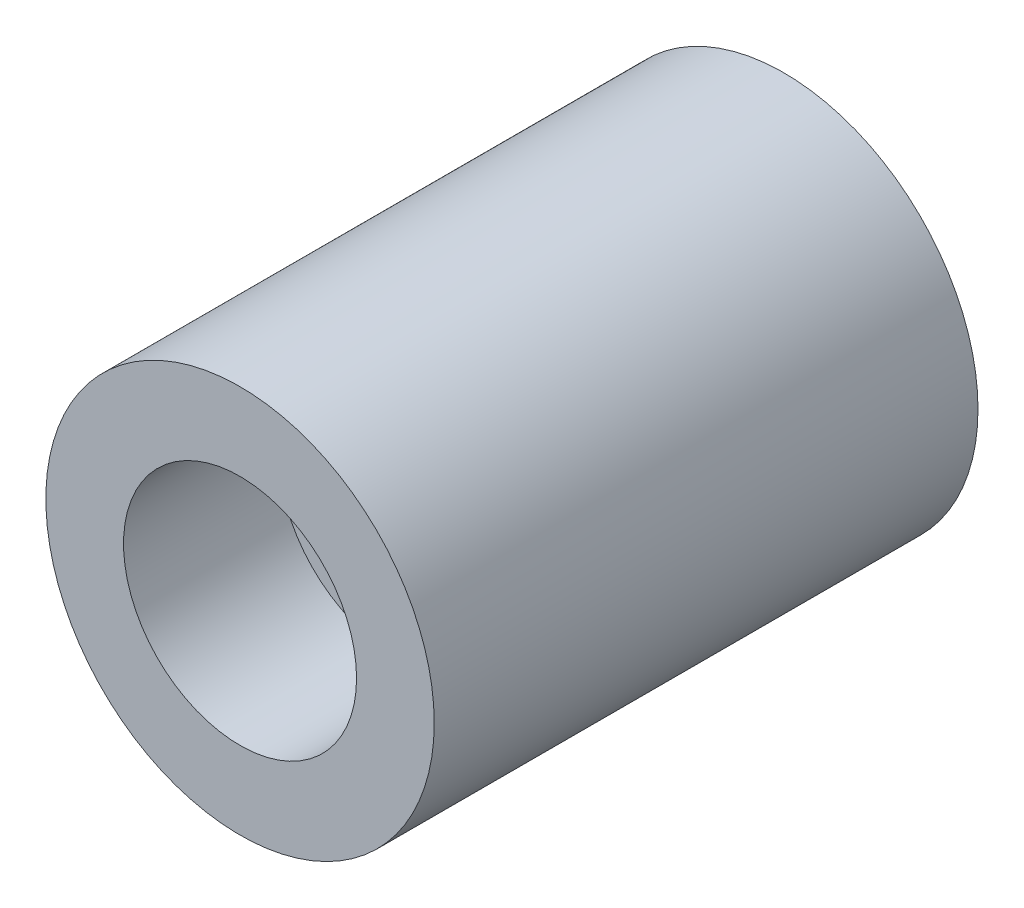
ISO-10303-21;
HEADER;
FILE_DESCRIPTION(('STEP AP214'),'2;1');
FILE_NAME('part.step','',(''),(''),'','','');
FILE_SCHEMA(('AUTOMOTIVE_DESIGN { 1 0 10303 214 1 1 1 1 }'));
ENDSEC;
DATA;
#1=APPLICATION_CONTEXT('core data for automotive mechanical design processes');
#2=APPLICATION_PROTOCOL_DEFINITION('international standard','automotive_design',2000,#1);
#3=PRODUCT_CONTEXT('',#1,'mechanical');
#4=PRODUCT('Part','Part','',(#3));
#5=PRODUCT_RELATED_PRODUCT_CATEGORY('part','',(#4));
#6=PRODUCT_DEFINITION_FORMATION('','',#4);
#7=PRODUCT_DEFINITION_CONTEXT('part definition',#1,'design');
#8=PRODUCT_DEFINITION('design','',#6,#7);
#9=PRODUCT_DEFINITION_SHAPE('','',#8);
#10=(LENGTH_UNIT() NAMED_UNIT(*) SI_UNIT(.MILLI.,.METRE.));
#11=(NAMED_UNIT(*) PLANE_ANGLE_UNIT() SI_UNIT($,.RADIAN.));
#12=(NAMED_UNIT(*) SI_UNIT($,.STERADIAN.) SOLID_ANGLE_UNIT());
#13=UNCERTAINTY_MEASURE_WITH_UNIT(LENGTH_MEASURE(1.E-05),#10,'distance_accuracy_value','');
#14=(GEOMETRIC_REPRESENTATION_CONTEXT(3) GLOBAL_UNCERTAINTY_ASSIGNED_CONTEXT((#13)) GLOBAL_UNIT_ASSIGNED_CONTEXT((#10,
#11,#12)) REPRESENTATION_CONTEXT('',''));
#15=CARTESIAN_POINT('',(0.,0.,0.));
#16=DIRECTION('',(0.,0.,1.));
#17=DIRECTION('',(1.,0.,0.));
#18=AXIS2_PLACEMENT_3D('',#15,#16,#17);
#19=CARTESIAN_POINT('',(0.,0.,140.));
#20=DIRECTION('',(0.,0.,-1.));
#21=DIRECTION('',(-1.,0.,0.));
#22=AXIS2_PLACEMENT_3D('',#19,#20,#21);
#23=CYLINDRICAL_SURFACE('',#22,50.);
#24=CARTESIAN_POINT('',(0.,0.,140.));
#25=DIRECTION('',(0.,0.,1.));
#26=DIRECTION('',(1.,0.,0.));
#27=AXIS2_PLACEMENT_3D('',#24,#25,#26);
#28=CIRCLE('',#27,50.);
#29=CARTESIAN_POINT('',(50.,0.,140.));
#30=VERTEX_POINT('',#29);
#31=EDGE_CURVE('E10',#30,#30,#28,.T.);
#32=ORIENTED_EDGE('',*,*,#31,.F.);
#33=EDGE_LOOP('',(#32));
#34=FACE_BOUND('',#33,.T.);
#35=CARTESIAN_POINT('',(0.,0.,0.));
#36=DIRECTION('',(0.,0.,1.));
#37=DIRECTION('',(1.,0.,0.));
#38=AXIS2_PLACEMENT_3D('',#35,#36,#37);
#39=CIRCLE('',#38,50.);
#40=CARTESIAN_POINT('',(50.,0.,0.));
#41=VERTEX_POINT('',#40);
#42=EDGE_CURVE('E38',#41,#41,#39,.T.);
#43=ORIENTED_EDGE('',*,*,#42,.T.);
#44=EDGE_LOOP('',(#43));
#45=FACE_BOUND('',#44,.T.);
#46=ADVANCED_FACE('F31',(#34,#45),#23,.T.);
#47=CARTESIAN_POINT('',(0.,0.,140.));
#48=DIRECTION('',(0.,0.,1.));
#49=DIRECTION('',(1.,0.,0.));
#50=AXIS2_PLACEMENT_3D('',#47,#48,#49);
#51=PLANE('',#50);
#52=CARTESIAN_POINT('',(0.,0.,140.));
#53=DIRECTION('',(0.,0.,1.));
#54=DIRECTION('',(1.,0.,0.));
#55=AXIS2_PLACEMENT_3D('',#52,#53,#54);
#56=CIRCLE('',#55,30.);
#57=CARTESIAN_POINT('',(30.,0.,140.));
#58=VERTEX_POINT('',#57);
#59=EDGE_CURVE('E45',#58,#58,#56,.T.);
#60=ORIENTED_EDGE('',*,*,#59,.F.);
#61=EDGE_LOOP('',(#60));
#62=FACE_BOUND('',#61,.T.);
#63=ORIENTED_EDGE('',*,*,#31,.T.);
#64=EDGE_LOOP('',(#63));
#65=FACE_BOUND('',#64,.T.);
#66=ADVANCED_FACE('F73',(#62,#65),#51,.T.);
#67=CARTESIAN_POINT('',(0.,0.,0.));
#68=DIRECTION('',(0.,0.,1.));
#69=DIRECTION('',(1.,0.,0.));
#70=AXIS2_PLACEMENT_3D('',#67,#68,#69);
#71=PLANE('',#70);
#72=ORIENTED_EDGE('',*,*,#42,.F.);
#73=EDGE_LOOP('',(#72));
#74=FACE_BOUND('',#73,.T.);
#75=ADVANCED_FACE('F69',(#74),#71,.F.);
#76=CARTESIAN_POINT('',(0.,0.,100.));
#77=DIRECTION('',(0.,0.,1.));
#78=DIRECTION('',(1.,0.,0.));
#79=AXIS2_PLACEMENT_3D('',#76,#77,#78);
#80=CYLINDRICAL_SURFACE('',#79,30.);
#81=CARTESIAN_POINT('',(0.,0.,100.));
#82=DIRECTION('',(0.,0.,1.));
#83=DIRECTION('',(1.,0.,0.));
#84=AXIS2_PLACEMENT_3D('',#81,#82,#83);
#85=CIRCLE('',#84,30.);
#86=CARTESIAN_POINT('',(30.,0.,100.));
#87=VERTEX_POINT('',#86);
#88=EDGE_CURVE('E43',#87,#87,#85,.T.);
#89=ORIENTED_EDGE('',*,*,#88,.F.);
#90=EDGE_LOOP('',(#89));
#91=FACE_BOUND('',#90,.T.);
#92=ORIENTED_EDGE('',*,*,#59,.T.);
#93=EDGE_LOOP('',(#92));
#94=FACE_BOUND('',#93,.T.);
#95=ADVANCED_FACE('F63',(#91,#94),#80,.F.);
#96=CARTESIAN_POINT('',(0.,0.,100.));
#97=DIRECTION('',(0.,0.,1.));
#98=DIRECTION('',(1.,0.,0.));
#99=AXIS2_PLACEMENT_3D('',#96,#97,#98);
#100=PLANE('',#99);
#101=CARTESIAN_POINT('',(0.,0.,100.));
#102=DIRECTION('',(0.,0.,1.));
#103=DIRECTION('',(1.,0.,0.));
#104=AXIS2_PLACEMENT_3D('',#101,#102,#103);
#105=CIRCLE('',#104,10.);
#106=CARTESIAN_POINT('',(10.,0.,100.));
#107=VERTEX_POINT('',#106);
#108=EDGE_CURVE('E34',#107,#107,#105,.T.);
#109=ORIENTED_EDGE('',*,*,#108,.F.);
#110=EDGE_LOOP('',(#109));
#111=FACE_BOUND('',#110,.T.);
#112=ORIENTED_EDGE('',*,*,#88,.T.);
#113=EDGE_LOOP('',(#112));
#114=FACE_BOUND('',#113,.T.);
#115=ADVANCED_FACE('F60',(#111,#114),#100,.T.);
#116=CARTESIAN_POINT('',(0.,0.,20.));
#117=DIRECTION('',(0.,0.,1.));
#118=DIRECTION('',(1.,0.,0.));
#119=AXIS2_PLACEMENT_3D('',#116,#117,#118);
#120=CYLINDRICAL_SURFACE('',#119,10.);
#121=ORIENTED_EDGE('',*,*,#108,.T.);
#122=EDGE_LOOP('',(#121));
#123=FACE_BOUND('',#122,.T.);
#124=CARTESIAN_POINT('',(0.,0.,20.));
#125=DIRECTION('',(0.,0.,1.));
#126=DIRECTION('',(1.,0.,0.));
#127=AXIS2_PLACEMENT_3D('',#124,#125,#126);
#128=CIRCLE('',#127,10.);
#129=CARTESIAN_POINT('',(10.,0.,20.));
#130=VERTEX_POINT('',#129);
#131=EDGE_CURVE('E50',#130,#130,#128,.T.);
#132=ORIENTED_EDGE('',*,*,#131,.F.);
#133=EDGE_LOOP('',(#132));
#134=FACE_BOUND('',#133,.T.);
#135=ADVANCED_FACE('F57',(#123,#134),#120,.F.);
#136=CARTESIAN_POINT('',(0.,0.,20.));
#137=DIRECTION('',(0.,0.,1.));
#138=DIRECTION('',(1.,0.,0.));
#139=AXIS2_PLACEMENT_3D('',#136,#137,#138);
#140=PLANE('',#139);
#141=ORIENTED_EDGE('',*,*,#131,.T.);
#142=EDGE_LOOP('',(#141));
#143=FACE_BOUND('',#142,.T.);
#144=ADVANCED_FACE('F85',(#143),#140,.T.);
#145=CLOSED_SHELL('',(#46,#66,#75,#95,#115,#135,#144));
#146=MANIFOLD_SOLID_BREP('B2',#145);
#147=ADVANCED_BREP_SHAPE_REPRESENTATION('',(#18,#146),#14);
#148=SHAPE_DEFINITION_REPRESENTATION(#9,#147);
ENDSEC;
END-ISO-10303-21;
